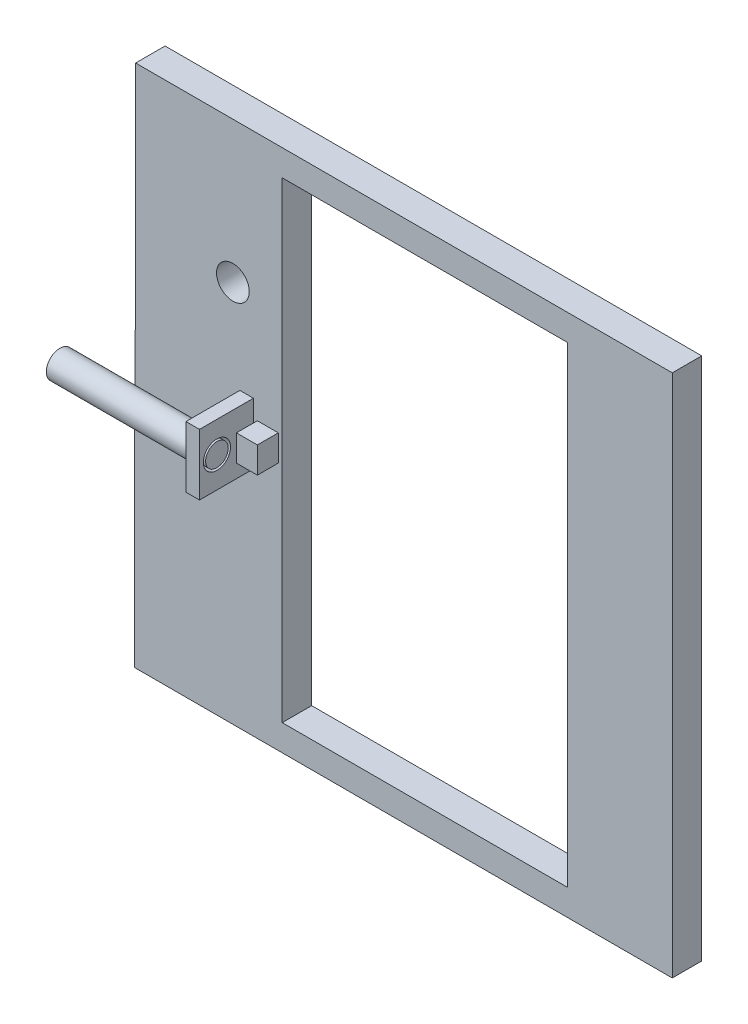
ISO-10303-21;
HEADER;
FILE_DESCRIPTION(('STEP AP214'),'2;1');
FILE_NAME('part.step','',(''),(''),'','','');
FILE_SCHEMA(('AUTOMOTIVE_DESIGN { 1 0 10303 214 1 1 1 1 }'));
ENDSEC;
DATA;
#1=APPLICATION_CONTEXT('core data for automotive mechanical design processes');
#2=APPLICATION_PROTOCOL_DEFINITION('international standard','automotive_design',2000,#1);
#3=PRODUCT_CONTEXT('',#1,'mechanical');
#4=PRODUCT('Part','Part','',(#3));
#5=PRODUCT_RELATED_PRODUCT_CATEGORY('part','',(#4));
#6=PRODUCT_DEFINITION_FORMATION('','',#4);
#7=PRODUCT_DEFINITION_CONTEXT('part definition',#1,'design');
#8=PRODUCT_DEFINITION('design','',#6,#7);
#9=PRODUCT_DEFINITION_SHAPE('','',#8);
#10=(LENGTH_UNIT() NAMED_UNIT(*) SI_UNIT(.MILLI.,.METRE.));
#11=(NAMED_UNIT(*) PLANE_ANGLE_UNIT() SI_UNIT($,.RADIAN.));
#12=(NAMED_UNIT(*) SI_UNIT($,.STERADIAN.) SOLID_ANGLE_UNIT());
#13=UNCERTAINTY_MEASURE_WITH_UNIT(LENGTH_MEASURE(1.E-05),#10,'distance_accuracy_value','');
#14=(GEOMETRIC_REPRESENTATION_CONTEXT(3) GLOBAL_UNCERTAINTY_ASSIGNED_CONTEXT((#13)) GLOBAL_UNIT_ASSIGNED_CONTEXT((#10,
#11,#12)) REPRESENTATION_CONTEXT('',''));
#15=CARTESIAN_POINT('',(0.,0.,0.));
#16=DIRECTION('',(0.,0.,1.));
#17=DIRECTION('',(1.,0.,0.));
#18=AXIS2_PLACEMENT_3D('',#15,#16,#17);
#19=CARTESIAN_POINT('',(-89.7638857165429,-14.8345030764574,-13.6525));
#20=DIRECTION('',(0.,1.,0.));
#21=DIRECTION('',(-1.,0.,0.));
#22=AXIS2_PLACEMENT_3D('',#19,#20,#21);
#23=PLANE('',#22);
#24=DIRECTION('',(1.,0.,0.));
#25=VECTOR('',#24,1.);
#26=CARTESIAN_POINT('',(-140.843,-14.8345030764574,-12.7));
#27=LINE('',#26,#25);
#28=CARTESIAN_POINT('',(-140.563885716543,-14.8345030764574,-12.7));
#29=VERTEX_POINT('',#28);
#30=CARTESIAN_POINT('',(-83.185,-14.8345030764574,-12.7));
#31=VERTEX_POINT('',#30);
#32=EDGE_CURVE('E222',#29,#31,#27,.T.);
#33=ORIENTED_EDGE('',*,*,#32,.F.);
#34=DIRECTION('',(0.,0.,1.));
#35=VECTOR('',#34,1.);
#36=CARTESIAN_POINT('',(-140.563885716543,-14.8345030764574,-13.6525));
#37=LINE('',#36,#35);
#38=CARTESIAN_POINT('',(-140.563885716543,-14.8345030764574,-13.6525));
#39=VERTEX_POINT('',#38);
#40=EDGE_CURVE('E247',#39,#29,#37,.T.);
#41=ORIENTED_EDGE('',*,*,#40,.F.);
#42=DIRECTION('',(1.,0.,0.));
#43=VECTOR('',#42,1.);
#44=CARTESIAN_POINT('',(-89.7638857165429,-14.8345030764574,-13.6525));
#45=LINE('',#44,#43);
#46=CARTESIAN_POINT('',(-83.185,-14.8345030764574,-13.6525));
#47=VERTEX_POINT('',#46);
#48=EDGE_CURVE('E300',#39,#47,#45,.T.);
#49=ORIENTED_EDGE('',*,*,#48,.T.);
#50=DIRECTION('',(0.,0.,1.));
#51=VECTOR('',#50,1.);
#52=CARTESIAN_POINT('',(-83.185,-14.8345030764574,-13.6525));
#53=LINE('',#52,#51);
#54=EDGE_CURVE('E298',#47,#31,#53,.T.);
#55=ORIENTED_EDGE('',*,*,#54,.T.);
#56=EDGE_LOOP('',(#33,#41,#49,#55));
#57=FACE_BOUND('',#56,.T.);
#58=ADVANCED_FACE('F37',(#57),#23,.F.);
#59=DIRECTION('',(1.,0.,0.));
#60=VECTOR('',#59,1.);
#61=CARTESIAN_POINT('',(-140.843,-14.8345030764574,1.5875));
#62=LINE('',#61,#60);
#63=CARTESIAN_POINT('',(-89.7638857165429,-14.8345030764574,1.5875));
#64=VERTEX_POINT('',#63);
#65=CARTESIAN_POINT('',(-83.185,-14.8345030764574,1.5875));
#66=VERTEX_POINT('',#65);
#67=EDGE_CURVE('E225',#64,#66,#62,.T.);
#68=ORIENTED_EDGE('',*,*,#67,.T.);
#69=DIRECTION('',(0.,0.,-1.));
#70=VECTOR('',#69,1.);
#71=CARTESIAN_POINT('',(-83.185,-14.8345030764574,27.7495));
#72=LINE('',#71,#70);
#73=CARTESIAN_POINT('',(-83.185,-14.8345030764574,27.7495));
#74=VERTEX_POINT('',#73);
#75=EDGE_CURVE('E290',#74,#66,#72,.T.);
#76=ORIENTED_EDGE('',*,*,#75,.F.);
#77=DIRECTION('',(1.,0.,0.));
#78=VECTOR('',#77,1.);
#79=CARTESIAN_POINT('',(-89.7638857165429,-14.8345030764574,27.7495));
#80=LINE('',#79,#78);
#81=CARTESIAN_POINT('',(-89.7638857165429,-14.8345030764574,27.7495));
#82=VERTEX_POINT('',#81);
#83=EDGE_CURVE('E279',#82,#74,#80,.T.);
#84=ORIENTED_EDGE('',*,*,#83,.F.);
#85=DIRECTION('',(0.,0.,1.));
#86=VECTOR('',#85,1.);
#87=CARTESIAN_POINT('',(-89.7638857165429,-14.8345030764574,-13.6525));
#88=LINE('',#87,#86);
#89=EDGE_CURVE('E297',#64,#82,#88,.T.);
#90=ORIENTED_EDGE('',*,*,#89,.F.);
#91=EDGE_LOOP('',(#68,#76,#84,#90));
#92=FACE_BOUND('',#91,.T.);
#93=ADVANCED_FACE('F428',(#92),#23,.F.);
#94=CARTESIAN_POINT('',(-89.7638857165429,14.8592290009901,-13.6525));
#95=DIRECTION('',(0.,-1.,0.));
#96=DIRECTION('',(1.,0.,0.));
#97=AXIS2_PLACEMENT_3D('',#94,#95,#96);
#98=PLANE('',#97);
#99=DIRECTION('',(1.,0.,0.));
#100=VECTOR('',#99,1.);
#101=CARTESIAN_POINT('',(-140.335,14.8592290009901,1.5875));
#102=LINE('',#101,#100);
#103=CARTESIAN_POINT('',(-89.7638857165429,14.8592290009901,1.5875));
#104=VERTEX_POINT('',#103);
#105=CARTESIAN_POINT('',(-83.185,14.8592290009901,1.5875));
#106=VERTEX_POINT('',#105);
#107=EDGE_CURVE('E237',#104,#106,#102,.T.);
#108=ORIENTED_EDGE('',*,*,#107,.F.);
#109=DIRECTION('',(0.,0.,-1.));
#110=VECTOR('',#109,1.);
#111=CARTESIAN_POINT('',(-89.7638857165429,14.8592290009901,-13.6525));
#112=LINE('',#111,#110);
#113=CARTESIAN_POINT('',(-89.7638857165429,14.8592290009901,27.7495));
#114=VERTEX_POINT('',#113);
#115=EDGE_CURVE('E294',#114,#104,#112,.T.);
#116=ORIENTED_EDGE('',*,*,#115,.F.);
#117=DIRECTION('',(-1.,0.,0.));
#118=VECTOR('',#117,1.);
#119=CARTESIAN_POINT('',(-89.7638857165429,14.8592290009901,27.7495));
#120=LINE('',#119,#118);
#121=CARTESIAN_POINT('',(-83.185,14.8592290009901,27.7495));
#122=VERTEX_POINT('',#121);
#123=EDGE_CURVE('E283',#122,#114,#120,.T.);
#124=ORIENTED_EDGE('',*,*,#123,.F.);
#125=DIRECTION('',(0.,0.,-1.));
#126=VECTOR('',#125,1.);
#127=CARTESIAN_POINT('',(-83.185,14.8592290009901,27.7495));
#128=LINE('',#127,#126);
#129=EDGE_CURVE('E286',#122,#106,#128,.T.);
#130=ORIENTED_EDGE('',*,*,#129,.T.);
#131=EDGE_LOOP('',(#108,#116,#124,#130));
#132=FACE_BOUND('',#131,.T.);
#133=ADVANCED_FACE('F420',(#132),#98,.F.);
#134=DIRECTION('',(1.,0.,0.));
#135=VECTOR('',#134,1.);
#136=CARTESIAN_POINT('',(-140.335,14.8592290009901,-12.7));
#137=LINE('',#136,#135);
#138=CARTESIAN_POINT('',(-140.335,14.8592290009901,-12.7));
#139=VERTEX_POINT('',#138);
#140=CARTESIAN_POINT('',(-83.185,14.8592290009901,-12.7));
#141=VERTEX_POINT('',#140);
#142=EDGE_CURVE('E240',#139,#141,#137,.T.);
#143=ORIENTED_EDGE('',*,*,#142,.T.);
#144=DIRECTION('',(0.,0.,-1.));
#145=VECTOR('',#144,1.);
#146=CARTESIAN_POINT('',(-83.185,14.8592290009901,-13.6525));
#147=LINE('',#146,#145);
#148=CARTESIAN_POINT('',(-83.185,14.8592290009901,-13.6525));
#149=VERTEX_POINT('',#148);
#150=EDGE_CURVE('E293',#141,#149,#147,.T.);
#151=ORIENTED_EDGE('',*,*,#150,.T.);
#152=DIRECTION('',(1.,0.,0.));
#153=VECTOR('',#152,1.);
#154=CARTESIAN_POINT('',(-89.7638857165429,14.8592290009901,-13.6525));
#155=LINE('',#154,#153);
#156=CARTESIAN_POINT('',(-140.563885716543,14.8592290009901,-13.6525));
#157=VERTEX_POINT('',#156);
#158=EDGE_CURVE('E308',#157,#149,#155,.T.);
#159=ORIENTED_EDGE('',*,*,#158,.F.);
#160=DIRECTION('',(0.,0.,-1.));
#161=VECTOR('',#160,1.);
#162=CARTESIAN_POINT('',(-140.563885716543,14.8592290009901,-13.6525));
#163=LINE('',#162,#161);
#164=CARTESIAN_POINT('',(-140.563885716543,14.8592290009901,1.5875));
#165=VERTEX_POINT('',#164);
#166=EDGE_CURVE('E252',#165,#157,#163,.T.);
#167=ORIENTED_EDGE('',*,*,#166,.F.);
#168=DIRECTION('',(1.,0.,0.));
#169=VECTOR('',#168,1.);
#170=CARTESIAN_POINT('',(-140.563885716543,14.8592290009901,1.5875));
#171=LINE('',#170,#169);
#172=CARTESIAN_POINT('',(-140.335,14.8592290009901,1.5875));
#173=VERTEX_POINT('',#172);
#174=EDGE_CURVE('E59',#165,#173,#171,.T.);
#175=ORIENTED_EDGE('',*,*,#174,.T.);
#176=DIRECTION('',(0.,0.,1.));
#177=VECTOR('',#176,1.);
#178=CARTESIAN_POINT('',(-140.335,14.8592290009901,-12.7));
#179=LINE('',#178,#177);
#180=EDGE_CURVE('E54',#139,#173,#179,.T.);
#181=ORIENTED_EDGE('',*,*,#180,.F.);
#182=EDGE_LOOP('',(#143,#151,#159,#167,#175,#181));
#183=FACE_BOUND('',#182,.T.);
#184=ADVANCED_FACE('F417',(#183),#98,.F.);
#185=CARTESIAN_POINT('',(-89.7638857165429,0.,0.));
#186=DIRECTION('',(1.,0.,0.));
#187=DIRECTION('',(0.,0.,-1.));
#188=AXIS2_PLACEMENT_3D('',#185,#186,#187);
#189=PLANE('',#188);
#190=CARTESIAN_POINT('',(-89.7638857165429,0.,19.2912049724316));
#191=DIRECTION('',(1.,0.,0.));
#192=DIRECTION('',(0.,0.,-1.));
#193=AXIS2_PLACEMENT_3D('',#190,#191,#192);
#194=CIRCLE('',#193,6.604);
#195=CARTESIAN_POINT('',(-89.7638857165429,0.,12.6872049724316));
#196=VERTEX_POINT('',#195);
#197=EDGE_CURVE('E272',#196,#196,#194,.T.);
#198=ORIENTED_EDGE('',*,*,#197,.T.);
#199=EDGE_LOOP('',(#198));
#200=FACE_BOUND('',#199,.T.);
#201=DIRECTION('',(0.,1.,0.));
#202=VECTOR('',#201,1.);
#203=CARTESIAN_POINT('',(-89.7638857165429,14.8592290009901,1.5875));
#204=LINE('',#203,#202);
#205=EDGE_CURVE('E242',#64,#104,#204,.T.);
#206=ORIENTED_EDGE('',*,*,#205,.F.);
#207=ORIENTED_EDGE('',*,*,#89,.T.);
#208=DIRECTION('',(0.,-1.,0.));
#209=VECTOR('',#208,1.);
#210=CARTESIAN_POINT('',(-89.7638857165429,14.8592290009901,27.7495));
#211=LINE('',#210,#209);
#212=EDGE_CURVE('E276',#114,#82,#211,.T.);
#213=ORIENTED_EDGE('',*,*,#212,.F.);
#214=ORIENTED_EDGE('',*,*,#115,.T.);
#215=EDGE_LOOP('',(#206,#207,#213,#214));
#216=FACE_BOUND('',#215,.T.);
#217=ADVANCED_FACE('F419',(#200,#216),#189,.F.);
#218=CARTESIAN_POINT('',(0.,0.,1.5875));
#219=DIRECTION('',(0.,0.,-1.));
#220=DIRECTION('',(-1.,0.,0.));
#221=AXIS2_PLACEMENT_3D('',#218,#219,#220);
#222=PLANE('',#221);
#223=CARTESIAN_POINT('',(-93.1412298345902,58.5900880823517,1.5875));
#224=DIRECTION('',(0.,0.,1.));
#225=DIRECTION('',(1.,0.,0.));
#226=AXIS2_PLACEMENT_3D('',#223,#224,#225);
#227=CIRCLE('',#226,7.93749999999999);
#228=CARTESIAN_POINT('',(-85.2037298345902,58.5900880823517,1.5875));
#229=VERTEX_POINT('',#228);
#230=EDGE_CURVE('E217',#229,#229,#227,.T.);
#231=ORIENTED_EDGE('',*,*,#230,.F.);
#232=EDGE_LOOP('',(#231));
#233=FACE_BOUND('',#232,.T.);
#234=DIRECTION('',(0.,1.,0.));
#235=VECTOR('',#234,1.);
#236=CARTESIAN_POINT('',(-140.843,-14.8345030764574,1.5875));
#237=LINE('',#236,#235);
#238=CARTESIAN_POINT('',(-140.843,-127.127,1.5875));
#239=VERTEX_POINT('',#238);
#240=CARTESIAN_POINT('',(-140.843,-14.8345030764574,1.5875));
#241=VERTEX_POINT('',#240);
#242=EDGE_CURVE('E209',#239,#241,#237,.T.);
#243=ORIENTED_EDGE('',*,*,#242,.F.);
#244=DIRECTION('',(1.,0.,0.));
#245=VECTOR('',#244,1.);
#246=CARTESIAN_POINT('',(120.015,-127.127,1.5875));
#247=LINE('',#246,#245);
#248=CARTESIAN_POINT('',(120.015,-127.127,1.5875));
#249=VERTEX_POINT('',#248);
#250=EDGE_CURVE('E206',#239,#249,#247,.T.);
#251=ORIENTED_EDGE('',*,*,#250,.T.);
#252=DIRECTION('',(0.,1.,0.));
#253=VECTOR('',#252,1.);
#254=CARTESIAN_POINT('',(120.015,127.127,1.5875));
#255=LINE('',#254,#253);
#256=CARTESIAN_POINT('',(120.015,127.127,1.5875));
#257=VERTEX_POINT('',#256);
#258=EDGE_CURVE('E356',#249,#257,#255,.T.);
#259=ORIENTED_EDGE('',*,*,#258,.T.);
#260=DIRECTION('',(-1.,0.,0.));
#261=VECTOR('',#260,1.);
#262=CARTESIAN_POINT('',(120.015,127.127,1.5875));
#263=LINE('',#262,#261);
#264=CARTESIAN_POINT('',(-140.335,127.127,1.5875));
#265=VERTEX_POINT('',#264);
#266=EDGE_CURVE('E359',#257,#265,#263,.T.);
#267=ORIENTED_EDGE('',*,*,#266,.T.);
#268=DIRECTION('',(0.,1.,0.));
#269=VECTOR('',#268,1.);
#270=CARTESIAN_POINT('',(-140.335,127.127,1.5875));
#271=LINE('',#270,#269);
#272=EDGE_CURVE('E231',#173,#265,#271,.T.);
#273=ORIENTED_EDGE('',*,*,#272,.F.);
#274=ORIENTED_EDGE('',*,*,#174,.F.);
#275=DIRECTION('',(0.,1.,0.));
#276=VECTOR('',#275,1.);
#277=CARTESIAN_POINT('',(-140.563885716543,14.8592290009901,1.5875));
#278=LINE('',#277,#276);
#279=CARTESIAN_POINT('',(-140.563885716543,-14.8345030764574,1.5875));
#280=VERTEX_POINT('',#279);
#281=EDGE_CURVE('E250',#280,#165,#278,.T.);
#282=ORIENTED_EDGE('',*,*,#281,.F.);
#283=EDGE_CURVE('E226',#241,#280,#62,.T.);
#284=ORIENTED_EDGE('',*,*,#283,.F.);
#285=EDGE_LOOP('',(#243,#251,#259,#267,#273,#274,#282,#284));
#286=FACE_BOUND('',#285,.T.);
#287=DIRECTION('',(0.,1.,0.));
#288=VECTOR('',#287,1.);
#289=CARTESIAN_POINT('',(-71.12,-6.35,1.5875));
#290=LINE('',#289,#288);
#291=CARTESIAN_POINT('',(-71.12,-6.35,1.5875));
#292=VERTEX_POINT('',#291);
#293=CARTESIAN_POINT('',(-71.12,6.35,1.5875));
#294=VERTEX_POINT('',#293);
#295=EDGE_CURVE('E311',#292,#294,#290,.T.);
#296=ORIENTED_EDGE('',*,*,#295,.F.);
#297=DIRECTION('',(1.,0.,0.));
#298=VECTOR('',#297,1.);
#299=CARTESIAN_POINT('',(-81.28,-6.35,1.5875));
#300=LINE('',#299,#298);
#301=CARTESIAN_POINT('',(-81.28,-6.35,1.5875));
#302=VERTEX_POINT('',#301);
#303=EDGE_CURVE('E316',#302,#292,#300,.T.);
#304=ORIENTED_EDGE('',*,*,#303,.F.);
#305=DIRECTION('',(0.,-1.,0.));
#306=VECTOR('',#305,1.);
#307=CARTESIAN_POINT('',(-81.28,-6.35,1.5875));
#308=LINE('',#307,#306);
#309=CARTESIAN_POINT('',(-81.28,6.35,1.5875));
#310=VERTEX_POINT('',#309);
#311=EDGE_CURVE('E328',#310,#302,#308,.T.);
#312=ORIENTED_EDGE('',*,*,#311,.F.);
#313=DIRECTION('',(-1.,0.,0.));
#314=VECTOR('',#313,1.);
#315=CARTESIAN_POINT('',(-81.28,6.35,1.5875));
#316=LINE('',#315,#314);
#317=EDGE_CURVE('E325',#294,#310,#316,.T.);
#318=ORIENTED_EDGE('',*,*,#317,.F.);
#319=EDGE_LOOP('',(#296,#304,#312,#318));
#320=FACE_BOUND('',#319,.T.);
#321=DIRECTION('',(0.,1.,0.));
#322=VECTOR('',#321,1.);
#323=CARTESIAN_POINT('',(69.215,-114.45875,1.5875));
#324=LINE('',#323,#322);
#325=CARTESIAN_POINT('',(69.215,-114.45875,1.5875));
#326=VERTEX_POINT('',#325);
#327=CARTESIAN_POINT('',(69.215,114.45875,1.5875));
#328=VERTEX_POINT('',#327);
#329=EDGE_CURVE('E344',#326,#328,#324,.T.);
#330=ORIENTED_EDGE('',*,*,#329,.F.);
#331=DIRECTION('',(1.,0.,0.));
#332=VECTOR('',#331,1.);
#333=CARTESIAN_POINT('',(-69.215,-114.45875,1.5875));
#334=LINE('',#333,#332);
#335=CARTESIAN_POINT('',(-69.215,-114.45875,1.5875));
#336=VERTEX_POINT('',#335);
#337=EDGE_CURVE('E353',#336,#326,#334,.T.);
#338=ORIENTED_EDGE('',*,*,#337,.F.);
#339=DIRECTION('',(0.,-1.,0.));
#340=VECTOR('',#339,1.);
#341=CARTESIAN_POINT('',(-69.215,-114.45875,1.5875));
#342=LINE('',#341,#340);
#343=CARTESIAN_POINT('',(-69.215,114.45875,1.5875));
#344=VERTEX_POINT('',#343);
#345=EDGE_CURVE('E350',#344,#336,#342,.T.);
#346=ORIENTED_EDGE('',*,*,#345,.F.);
#347=DIRECTION('',(-1.,0.,0.));
#348=VECTOR('',#347,1.);
#349=CARTESIAN_POINT('',(-69.215,114.45875,1.5875));
#350=LINE('',#349,#348);
#351=EDGE_CURVE('E347',#328,#344,#350,.T.);
#352=ORIENTED_EDGE('',*,*,#351,.F.);
#353=EDGE_LOOP('',(#330,#338,#346,#352));
#354=FACE_BOUND('',#353,.T.);
#355=DIRECTION('',(0.,1.,0.));
#356=VECTOR('',#355,1.);
#357=CARTESIAN_POINT('',(-83.185,14.8592290009901,1.5875));
#358=LINE('',#357,#356);
#359=EDGE_CURVE('E275',#66,#106,#358,.T.);
#360=ORIENTED_EDGE('',*,*,#359,.F.);
#361=ORIENTED_EDGE('',*,*,#67,.F.);
#362=ORIENTED_EDGE('',*,*,#205,.T.);
#363=ORIENTED_EDGE('',*,*,#107,.T.);
#364=EDGE_LOOP('',(#360,#361,#362,#363));
#365=FACE_BOUND('',#364,.T.);
#366=ADVANCED_FACE('F394',(#233,#286,#320,#354,#365),#222,.F.);
#367=CARTESIAN_POINT('',(120.015,127.127,-12.7));
#368=DIRECTION('',(1.,0.,0.));
#369=DIRECTION('',(0.,1.,0.));
#370=AXIS2_PLACEMENT_3D('',#367,#368,#369);
#371=PLANE('',#370);
#372=DIRECTION('',(0.,0.,1.));
#373=VECTOR('',#372,1.);
#374=CARTESIAN_POINT('',(120.015,127.127,-12.7));
#375=LINE('',#374,#373);
#376=CARTESIAN_POINT('',(120.015,127.127,-12.7));
#377=VERTEX_POINT('',#376);
#378=EDGE_CURVE('E46',#377,#257,#375,.T.);
#379=ORIENTED_EDGE('',*,*,#378,.T.);
#380=ORIENTED_EDGE('',*,*,#258,.F.);
#381=DIRECTION('',(0.,0.,1.));
#382=VECTOR('',#381,1.);
#383=CARTESIAN_POINT('',(120.015,-127.127,-12.7));
#384=LINE('',#383,#382);
#385=CARTESIAN_POINT('',(120.015,-127.127,-12.7));
#386=VERTEX_POINT('',#385);
#387=EDGE_CURVE('E11',#386,#249,#384,.T.);
#388=ORIENTED_EDGE('',*,*,#387,.F.);
#389=DIRECTION('',(0.,1.,0.));
#390=VECTOR('',#389,1.);
#391=CARTESIAN_POINT('',(120.015,127.127,-12.7));
#392=LINE('',#391,#390);
#393=EDGE_CURVE('E198',#386,#377,#392,.T.);
#394=ORIENTED_EDGE('',*,*,#393,.T.);
#395=EDGE_LOOP('',(#379,#380,#388,#394));
#396=FACE_BOUND('',#395,.T.);
#397=ADVANCED_FACE('F39',(#396),#371,.T.);
#398=CARTESIAN_POINT('',(120.015,-127.127,-12.7));
#399=DIRECTION('',(0.,-1.,0.));
#400=DIRECTION('',(1.,0.,0.));
#401=AXIS2_PLACEMENT_3D('',#398,#399,#400);
#402=PLANE('',#401);
#403=ORIENTED_EDGE('',*,*,#387,.T.);
#404=ORIENTED_EDGE('',*,*,#250,.F.);
#405=DIRECTION('',(0.,0.,1.));
#406=VECTOR('',#405,1.);
#407=CARTESIAN_POINT('',(-140.843,-127.127,-12.7));
#408=LINE('',#407,#406);
#409=CARTESIAN_POINT('',(-140.843,-127.127,-12.7));
#410=VERTEX_POINT('',#409);
#411=EDGE_CURVE('E203',#410,#239,#408,.T.);
#412=ORIENTED_EDGE('',*,*,#411,.F.);
#413=DIRECTION('',(1.,0.,0.));
#414=VECTOR('',#413,1.);
#415=CARTESIAN_POINT('',(120.015,-127.127,-12.7));
#416=LINE('',#415,#414);
#417=EDGE_CURVE('E190',#410,#386,#416,.T.);
#418=ORIENTED_EDGE('',*,*,#417,.T.);
#419=EDGE_LOOP('',(#403,#404,#412,#418));
#420=FACE_BOUND('',#419,.T.);
#421=ADVANCED_FACE('F204',(#420),#402,.T.);
#422=CARTESIAN_POINT('',(120.015,127.127,-12.7));
#423=DIRECTION('',(0.,1.,0.));
#424=DIRECTION('',(-1.,0.,0.));
#425=AXIS2_PLACEMENT_3D('',#422,#423,#424);
#426=PLANE('',#425);
#427=DIRECTION('',(-1.,0.,0.));
#428=VECTOR('',#427,1.);
#429=CARTESIAN_POINT('',(120.015,127.127,-12.7));
#430=LINE('',#429,#428);
#431=CARTESIAN_POINT('',(-140.335,127.127,-12.7));
#432=VERTEX_POINT('',#431);
#433=EDGE_CURVE('E383',#377,#432,#430,.T.);
#434=ORIENTED_EDGE('',*,*,#433,.T.);
#435=DIRECTION('',(0.,0.,-1.));
#436=VECTOR('',#435,1.);
#437=CARTESIAN_POINT('',(-140.335,127.127,-12.7));
#438=LINE('',#437,#436);
#439=EDGE_CURVE('E234',#265,#432,#438,.T.);
#440=ORIENTED_EDGE('',*,*,#439,.F.);
#441=ORIENTED_EDGE('',*,*,#266,.F.);
#442=ORIENTED_EDGE('',*,*,#378,.F.);
#443=EDGE_LOOP('',(#434,#440,#441,#442));
#444=FACE_BOUND('',#443,.T.);
#445=ADVANCED_FACE('F391',(#444),#426,.T.);
#446=CARTESIAN_POINT('',(0.,0.,-12.7));
#447=DIRECTION('',(0.,0.,-1.));
#448=DIRECTION('',(-1.,0.,0.));
#449=AXIS2_PLACEMENT_3D('',#446,#447,#448);
#450=PLANE('',#449);
#451=CARTESIAN_POINT('',(-93.1412298345902,58.5900880823517,-12.7));
#452=DIRECTION('',(0.,0.,-1.));
#453=DIRECTION('',(-1.,0.,0.));
#454=AXIS2_PLACEMENT_3D('',#451,#452,#453);
#455=CIRCLE('',#454,7.93749999999999);
#456=CARTESIAN_POINT('',(-101.07872983459,58.5900880823517,-12.7));
#457=VERTEX_POINT('',#456);
#458=EDGE_CURVE('E41',#457,#457,#455,.T.);
#459=ORIENTED_EDGE('',*,*,#458,.F.);
#460=EDGE_LOOP('',(#459));
#461=FACE_BOUND('',#460,.T.);
#462=DIRECTION('',(0.,1.,0.));
#463=VECTOR('',#462,1.);
#464=CARTESIAN_POINT('',(69.215,-114.45875,-12.7));
#465=LINE('',#464,#463);
#466=CARTESIAN_POINT('',(69.215,-114.45875,-12.7));
#467=VERTEX_POINT('',#466);
#468=CARTESIAN_POINT('',(69.215,114.45875,-12.7));
#469=VERTEX_POINT('',#468);
#470=EDGE_CURVE('E362',#467,#469,#465,.T.);
#471=ORIENTED_EDGE('',*,*,#470,.T.);
#472=DIRECTION('',(-1.,0.,0.));
#473=VECTOR('',#472,1.);
#474=CARTESIAN_POINT('',(-69.215,114.45875,-12.7));
#475=LINE('',#474,#473);
#476=CARTESIAN_POINT('',(-69.215,114.45875,-12.7));
#477=VERTEX_POINT('',#476);
#478=EDGE_CURVE('E365',#469,#477,#475,.T.);
#479=ORIENTED_EDGE('',*,*,#478,.T.);
#480=DIRECTION('',(0.,-1.,0.));
#481=VECTOR('',#480,1.);
#482=CARTESIAN_POINT('',(-69.215,-114.45875,-12.7));
#483=LINE('',#482,#481);
#484=CARTESIAN_POINT('',(-69.215,-114.45875,-12.7));
#485=VERTEX_POINT('',#484);
#486=EDGE_CURVE('E368',#477,#485,#483,.T.);
#487=ORIENTED_EDGE('',*,*,#486,.T.);
#488=DIRECTION('',(1.,0.,0.));
#489=VECTOR('',#488,1.);
#490=CARTESIAN_POINT('',(-69.215,-114.45875,-12.7));
#491=LINE('',#490,#489);
#492=EDGE_CURVE('E371',#485,#467,#491,.T.);
#493=ORIENTED_EDGE('',*,*,#492,.T.);
#494=EDGE_LOOP('',(#471,#479,#487,#493));
#495=FACE_BOUND('',#494,.T.);
#496=ORIENTED_EDGE('',*,*,#393,.F.);
#497=ORIENTED_EDGE('',*,*,#417,.F.);
#498=DIRECTION('',(0.,-1.,0.));
#499=VECTOR('',#498,1.);
#500=CARTESIAN_POINT('',(-140.843,-14.8345030764574,-12.7));
#501=LINE('',#500,#499);
#502=CARTESIAN_POINT('',(-140.843,-14.8345030764574,-12.7));
#503=VERTEX_POINT('',#502);
#504=EDGE_CURVE('E195',#503,#410,#501,.T.);
#505=ORIENTED_EDGE('',*,*,#504,.F.);
#506=EDGE_CURVE('E223',#503,#29,#27,.T.);
#507=ORIENTED_EDGE('',*,*,#506,.T.);
#508=ORIENTED_EDGE('',*,*,#32,.T.);
#509=DIRECTION('',(0.,-1.,0.));
#510=VECTOR('',#509,1.);
#511=CARTESIAN_POINT('',(-83.185,127.127,-12.7));
#512=LINE('',#511,#510);
#513=EDGE_CURVE('E200',#141,#31,#512,.T.);
#514=ORIENTED_EDGE('',*,*,#513,.F.);
#515=ORIENTED_EDGE('',*,*,#142,.F.);
#516=DIRECTION('',(0.,-1.,0.));
#517=VECTOR('',#516,1.);
#518=CARTESIAN_POINT('',(-140.335,127.127,-12.7));
#519=LINE('',#518,#517);
#520=EDGE_CURVE('E228',#432,#139,#519,.T.);
#521=ORIENTED_EDGE('',*,*,#520,.F.);
#522=ORIENTED_EDGE('',*,*,#433,.F.);
#523=EDGE_LOOP('',(#496,#497,#505,#507,#508,#514,#515,#521,#522));
#524=FACE_BOUND('',#523,.T.);
#525=ADVANCED_FACE('F192',(#461,#495,#524),#450,.T.);
#526=CARTESIAN_POINT('',(69.215,-114.45875,-12.7));
#527=DIRECTION('',(1.,0.,0.));
#528=DIRECTION('',(0.,0.,-1.));
#529=AXIS2_PLACEMENT_3D('',#526,#527,#528);
#530=PLANE('',#529);
#531=DIRECTION('',(0.,0.,1.));
#532=VECTOR('',#531,1.);
#533=CARTESIAN_POINT('',(69.215,-114.45875,-12.7));
#534=LINE('',#533,#532);
#535=EDGE_CURVE('E375',#467,#326,#534,.T.);
#536=ORIENTED_EDGE('',*,*,#535,.T.);
#537=ORIENTED_EDGE('',*,*,#329,.T.);
#538=DIRECTION('',(0.,0.,1.));
#539=VECTOR('',#538,1.);
#540=CARTESIAN_POINT('',(69.215,114.45875,-12.7));
#541=LINE('',#540,#539);
#542=EDGE_CURVE('E374',#469,#328,#541,.T.);
#543=ORIENTED_EDGE('',*,*,#542,.F.);
#544=ORIENTED_EDGE('',*,*,#470,.F.);
#545=EDGE_LOOP('',(#536,#537,#543,#544));
#546=FACE_BOUND('',#545,.T.);
#547=ADVANCED_FACE('F474',(#546),#530,.F.);
#548=CARTESIAN_POINT('',(-69.215,-114.45875,-12.7));
#549=DIRECTION('',(0.,-1.,0.));
#550=DIRECTION('',(0.,0.,-1.));
#551=AXIS2_PLACEMENT_3D('',#548,#549,#550);
#552=PLANE('',#551);
#553=DIRECTION('',(0.,0.,1.));
#554=VECTOR('',#553,1.);
#555=CARTESIAN_POINT('',(-69.215,-114.45875,-12.7));
#556=LINE('',#555,#554);
#557=EDGE_CURVE('E377',#485,#336,#556,.T.);
#558=ORIENTED_EDGE('',*,*,#557,.T.);
#559=ORIENTED_EDGE('',*,*,#337,.T.);
#560=ORIENTED_EDGE('',*,*,#535,.F.);
#561=ORIENTED_EDGE('',*,*,#492,.F.);
#562=EDGE_LOOP('',(#558,#559,#560,#561));
#563=FACE_BOUND('',#562,.T.);
#564=ADVANCED_FACE('F470',(#563),#552,.F.);
#565=CARTESIAN_POINT('',(-69.215,-114.45875,-12.7));
#566=DIRECTION('',(-1.,0.,0.));
#567=DIRECTION('',(0.,0.,1.));
#568=AXIS2_PLACEMENT_3D('',#565,#566,#567);
#569=PLANE('',#568);
#570=DIRECTION('',(0.,0.,1.));
#571=VECTOR('',#570,1.);
#572=CARTESIAN_POINT('',(-69.215,114.45875,-12.7));
#573=LINE('',#572,#571);
#574=EDGE_CURVE('E379',#477,#344,#573,.T.);
#575=ORIENTED_EDGE('',*,*,#574,.T.);
#576=ORIENTED_EDGE('',*,*,#345,.T.);
#577=ORIENTED_EDGE('',*,*,#557,.F.);
#578=ORIENTED_EDGE('',*,*,#486,.F.);
#579=EDGE_LOOP('',(#575,#576,#577,#578));
#580=FACE_BOUND('',#579,.T.);
#581=ADVANCED_FACE('F473',(#580),#569,.F.);
#582=CARTESIAN_POINT('',(-69.215,114.45875,-12.7));
#583=DIRECTION('',(0.,1.,0.));
#584=DIRECTION('',(0.,0.,1.));
#585=AXIS2_PLACEMENT_3D('',#582,#583,#584);
#586=PLANE('',#585);
#587=ORIENTED_EDGE('',*,*,#542,.T.);
#588=ORIENTED_EDGE('',*,*,#351,.T.);
#589=ORIENTED_EDGE('',*,*,#574,.F.);
#590=ORIENTED_EDGE('',*,*,#478,.F.);
#591=EDGE_LOOP('',(#587,#588,#589,#590));
#592=FACE_BOUND('',#591,.T.);
#593=ADVANCED_FACE('F465',(#592),#586,.F.);
#594=CARTESIAN_POINT('',(-71.12,-6.35,11.7475));
#595=DIRECTION('',(-1.,0.,0.));
#596=DIRECTION('',(0.,0.,1.));
#597=AXIS2_PLACEMENT_3D('',#594,#595,#596);
#598=PLANE('',#597);
#599=ORIENTED_EDGE('',*,*,#295,.T.);
#600=DIRECTION('',(0.,0.,-1.));
#601=VECTOR('',#600,1.);
#602=CARTESIAN_POINT('',(-71.12,6.35,11.7475));
#603=LINE('',#602,#601);
#604=CARTESIAN_POINT('',(-71.12,6.35,11.7475));
#605=VERTEX_POINT('',#604);
#606=EDGE_CURVE('E341',#605,#294,#603,.T.);
#607=ORIENTED_EDGE('',*,*,#606,.F.);
#608=DIRECTION('',(0.,1.,0.));
#609=VECTOR('',#608,1.);
#610=CARTESIAN_POINT('',(-71.12,-6.35,11.7475));
#611=LINE('',#610,#609);
#612=CARTESIAN_POINT('',(-71.12,-6.35,11.7475));
#613=VERTEX_POINT('',#612);
#614=EDGE_CURVE('E312',#613,#605,#611,.T.);
#615=ORIENTED_EDGE('',*,*,#614,.F.);
#616=DIRECTION('',(0.,0.,-1.));
#617=VECTOR('',#616,1.);
#618=CARTESIAN_POINT('',(-71.12,-6.35,11.7475));
#619=LINE('',#618,#617);
#620=EDGE_CURVE('E322',#613,#292,#619,.T.);
#621=ORIENTED_EDGE('',*,*,#620,.T.);
#622=EDGE_LOOP('',(#599,#607,#615,#621));
#623=FACE_BOUND('',#622,.T.);
#624=ADVANCED_FACE('F461',(#623),#598,.F.);
#625=CARTESIAN_POINT('',(-81.28,6.35,11.7475));
#626=DIRECTION('',(0.,-1.,0.));
#627=DIRECTION('',(0.,0.,-1.));
#628=AXIS2_PLACEMENT_3D('',#625,#626,#627);
#629=PLANE('',#628);
#630=ORIENTED_EDGE('',*,*,#317,.T.);
#631=DIRECTION('',(0.,0.,-1.));
#632=VECTOR('',#631,1.);
#633=CARTESIAN_POINT('',(-81.28,6.35,11.7475));
#634=LINE('',#633,#632);
#635=CARTESIAN_POINT('',(-81.28,6.35,11.7475));
#636=VERTEX_POINT('',#635);
#637=EDGE_CURVE('E338',#636,#310,#634,.T.);
#638=ORIENTED_EDGE('',*,*,#637,.F.);
#639=DIRECTION('',(-1.,0.,0.));
#640=VECTOR('',#639,1.);
#641=CARTESIAN_POINT('',(-81.28,6.35,11.7475));
#642=LINE('',#641,#640);
#643=EDGE_CURVE('E315',#605,#636,#642,.T.);
#644=ORIENTED_EDGE('',*,*,#643,.F.);
#645=ORIENTED_EDGE('',*,*,#606,.T.);
#646=EDGE_LOOP('',(#630,#638,#644,#645));
#647=FACE_BOUND('',#646,.T.);
#648=ADVANCED_FACE('F457',(#647),#629,.F.);
#649=CARTESIAN_POINT('',(-81.28,-6.35,11.7475));
#650=DIRECTION('',(1.,0.,0.));
#651=DIRECTION('',(0.,0.,-1.));
#652=AXIS2_PLACEMENT_3D('',#649,#650,#651);
#653=PLANE('',#652);
#654=ORIENTED_EDGE('',*,*,#311,.T.);
#655=DIRECTION('',(0.,0.,-1.));
#656=VECTOR('',#655,1.);
#657=CARTESIAN_POINT('',(-81.28,-6.35,11.7475));
#658=LINE('',#657,#656);
#659=CARTESIAN_POINT('',(-81.28,-6.35,11.7475));
#660=VERTEX_POINT('',#659);
#661=EDGE_CURVE('E335',#660,#302,#658,.T.);
#662=ORIENTED_EDGE('',*,*,#661,.F.);
#663=DIRECTION('',(0.,-1.,0.));
#664=VECTOR('',#663,1.);
#665=CARTESIAN_POINT('',(-81.28,-6.35,11.7475));
#666=LINE('',#665,#664);
#667=EDGE_CURVE('E318',#636,#660,#666,.T.);
#668=ORIENTED_EDGE('',*,*,#667,.F.);
#669=ORIENTED_EDGE('',*,*,#637,.T.);
#670=EDGE_LOOP('',(#654,#662,#668,#669));
#671=FACE_BOUND('',#670,.T.);
#672=ADVANCED_FACE('F451',(#671),#653,.F.);
#673=CARTESIAN_POINT('',(-81.28,-6.35,11.7475));
#674=DIRECTION('',(0.,1.,0.));
#675=DIRECTION('',(0.,0.,1.));
#676=AXIS2_PLACEMENT_3D('',#673,#674,#675);
#677=PLANE('',#676);
#678=ORIENTED_EDGE('',*,*,#303,.T.);
#679=ORIENTED_EDGE('',*,*,#620,.F.);
#680=DIRECTION('',(1.,0.,0.));
#681=VECTOR('',#680,1.);
#682=CARTESIAN_POINT('',(-81.28,-6.35,11.7475));
#683=LINE('',#682,#681);
#684=EDGE_CURVE('E320',#660,#613,#683,.T.);
#685=ORIENTED_EDGE('',*,*,#684,.F.);
#686=ORIENTED_EDGE('',*,*,#661,.T.);
#687=EDGE_LOOP('',(#678,#679,#685,#686));
#688=FACE_BOUND('',#687,.T.);
#689=ADVANCED_FACE('F446',(#688),#677,.F.);
#690=CARTESIAN_POINT('',(0.,0.,11.7475));
#691=DIRECTION('',(0.,0.,-1.));
#692=DIRECTION('',(-1.,0.,0.));
#693=AXIS2_PLACEMENT_3D('',#690,#691,#692);
#694=PLANE('',#693);
#695=ORIENTED_EDGE('',*,*,#614,.T.);
#696=ORIENTED_EDGE('',*,*,#643,.T.);
#697=ORIENTED_EDGE('',*,*,#667,.T.);
#698=ORIENTED_EDGE('',*,*,#684,.T.);
#699=EDGE_LOOP('',(#695,#696,#697,#698));
#700=FACE_BOUND('',#699,.T.);
#701=ADVANCED_FACE('F440',(#700),#694,.F.);
#702=CARTESIAN_POINT('',(-89.7638857165429,-14.8345030764574,-13.6525));
#703=DIRECTION('',(0.,0.,1.));
#704=DIRECTION('',(1.,0.,0.));
#705=AXIS2_PLACEMENT_3D('',#702,#703,#704);
#706=PLANE('',#705);
#707=DIRECTION('',(0.,-1.,0.));
#708=VECTOR('',#707,1.);
#709=CARTESIAN_POINT('',(-83.185,-14.8345030764574,-13.6525));
#710=LINE('',#709,#708);
#711=EDGE_CURVE('E302',#149,#47,#710,.T.);
#712=ORIENTED_EDGE('',*,*,#711,.T.);
#713=ORIENTED_EDGE('',*,*,#48,.F.);
#714=DIRECTION('',(0.,-1.,0.));
#715=VECTOR('',#714,1.);
#716=CARTESIAN_POINT('',(-140.563885716543,14.8592290009901,-13.6525));
#717=LINE('',#716,#715);
#718=EDGE_CURVE('E243',#157,#39,#717,.T.);
#719=ORIENTED_EDGE('',*,*,#718,.F.);
#720=ORIENTED_EDGE('',*,*,#158,.T.);
#721=EDGE_LOOP('',(#712,#713,#719,#720));
#722=FACE_BOUND('',#721,.T.);
#723=ADVANCED_FACE('F410',(#722),#706,.F.);
#724=CARTESIAN_POINT('',(-83.185,0.,0.));
#725=DIRECTION('',(1.,0.,0.));
#726=DIRECTION('',(0.,0.,-1.));
#727=AXIS2_PLACEMENT_3D('',#724,#725,#726);
#728=PLANE('',#727);
#729=ORIENTED_EDGE('',*,*,#150,.F.);
#730=ORIENTED_EDGE('',*,*,#513,.T.);
#731=ORIENTED_EDGE('',*,*,#54,.F.);
#732=ORIENTED_EDGE('',*,*,#711,.F.);
#733=EDGE_LOOP('',(#729,#730,#731,#732));
#734=FACE_BOUND('',#733,.T.);
#735=ADVANCED_FACE('F414',(#734),#728,.T.);
#736=CARTESIAN_POINT('',(-83.185,14.8592290009901,27.7495));
#737=DIRECTION('',(-1.,0.,0.));
#738=DIRECTION('',(0.,0.,1.));
#739=AXIS2_PLACEMENT_3D('',#736,#737,#738);
#740=PLANE('',#739);
#741=CARTESIAN_POINT('',(-83.185,0.,19.2912049724316));
#742=DIRECTION('',(1.,0.,0.));
#743=DIRECTION('',(0.,0.,-1.));
#744=AXIS2_PLACEMENT_3D('',#741,#742,#743);
#745=CIRCLE('',#744,6.604);
#746=CARTESIAN_POINT('',(-83.185,0.,12.6872049724316));
#747=VERTEX_POINT('',#746);
#748=EDGE_CURVE('E261',#747,#747,#745,.T.);
#749=ORIENTED_EDGE('',*,*,#748,.F.);
#750=EDGE_LOOP('',(#749));
#751=FACE_BOUND('',#750,.T.);
#752=ORIENTED_EDGE('',*,*,#359,.T.);
#753=ORIENTED_EDGE('',*,*,#129,.F.);
#754=DIRECTION('',(0.,1.,0.));
#755=VECTOR('',#754,1.);
#756=CARTESIAN_POINT('',(-83.185,14.8592290009901,27.7495));
#757=LINE('',#756,#755);
#758=EDGE_CURVE('E281',#74,#122,#757,.T.);
#759=ORIENTED_EDGE('',*,*,#758,.F.);
#760=ORIENTED_EDGE('',*,*,#75,.T.);
#761=EDGE_LOOP('',(#752,#753,#759,#760));
#762=FACE_BOUND('',#761,.T.);
#763=ADVANCED_FACE('F445',(#751,#762),#740,.F.);
#764=CARTESIAN_POINT('',(0.,0.,27.7495));
#765=DIRECTION('',(0.,0.,1.));
#766=DIRECTION('',(1.,0.,0.));
#767=AXIS2_PLACEMENT_3D('',#764,#765,#766);
#768=PLANE('',#767);
#769=ORIENTED_EDGE('',*,*,#212,.T.);
#770=ORIENTED_EDGE('',*,*,#83,.T.);
#771=ORIENTED_EDGE('',*,*,#758,.T.);
#772=ORIENTED_EDGE('',*,*,#123,.T.);
#773=EDGE_LOOP('',(#769,#770,#771,#772));
#774=FACE_BOUND('',#773,.T.);
#775=ADVANCED_FACE('F545',(#774),#768,.T.);
#776=CARTESIAN_POINT('',(-159.385,0.,19.2912049724316));
#777=DIRECTION('',(1.,0.,0.));
#778=DIRECTION('',(0.,0.,-1.));
#779=AXIS2_PLACEMENT_3D('',#776,#777,#778);
#780=CYLINDRICAL_SURFACE('',#779,6.604);
#781=CARTESIAN_POINT('',(-159.385,0.,19.2912049724316));
#782=DIRECTION('',(1.,0.,0.));
#783=DIRECTION('',(0.,0.,-1.));
#784=AXIS2_PLACEMENT_3D('',#781,#782,#783);
#785=CIRCLE('',#784,6.604);
#786=CARTESIAN_POINT('',(-159.385,0.,12.6872049724316));
#787=VERTEX_POINT('',#786);
#788=EDGE_CURVE('E267',#787,#787,#785,.T.);
#789=ORIENTED_EDGE('',*,*,#788,.T.);
#790=EDGE_LOOP('',(#789));
#791=FACE_BOUND('',#790,.T.);
#792=ORIENTED_EDGE('',*,*,#197,.F.);
#793=EDGE_LOOP('',(#792));
#794=FACE_BOUND('',#793,.T.);
#795=ADVANCED_FACE('F550',(#791,#794),#780,.T.);
#796=CARTESIAN_POINT('',(-159.385,0.,19.2912049724316));
#797=DIRECTION('',(1.,0.,0.));
#798=DIRECTION('',(0.,0.,-1.));
#799=AXIS2_PLACEMENT_3D('',#796,#797,#798);
#800=PLANE('',#799);
#801=ORIENTED_EDGE('',*,*,#788,.F.);
#802=EDGE_LOOP('',(#801));
#803=FACE_BOUND('',#802,.T.);
#804=ADVANCED_FACE('F562',(#803),#800,.F.);
#805=CARTESIAN_POINT('',(-89.027,0.,19.2912049724316));
#806=DIRECTION('',(1.,0.,0.));
#807=DIRECTION('',(0.,0.,-1.));
#808=AXIS2_PLACEMENT_3D('',#805,#806,#807);
#809=CYLINDRICAL_SURFACE('',#808,6.604);
#810=CARTESIAN_POINT('',(-89.027,0.,19.2912049724316));
#811=DIRECTION('',(1.,0.,0.));
#812=DIRECTION('',(0.,0.,-1.));
#813=AXIS2_PLACEMENT_3D('',#810,#811,#812);
#814=CIRCLE('',#813,6.604);
#815=CARTESIAN_POINT('',(-89.027,0.,12.6872049724316));
#816=VERTEX_POINT('',#815);
#817=EDGE_CURVE('E264',#816,#816,#814,.T.);
#818=ORIENTED_EDGE('',*,*,#817,.F.);
#819=EDGE_LOOP('',(#818));
#820=FACE_BOUND('',#819,.T.);
#821=ORIENTED_EDGE('',*,*,#748,.T.);
#822=EDGE_LOOP('',(#821));
#823=FACE_BOUND('',#822,.T.);
#824=ADVANCED_FACE('F572',(#820,#823),#809,.F.);
#825=CARTESIAN_POINT('',(-89.027,0.,19.2912049724316));
#826=DIRECTION('',(1.,0.,0.));
#827=DIRECTION('',(0.,0.,-1.));
#828=AXIS2_PLACEMENT_3D('',#825,#826,#827);
#829=PLANE('',#828);
#830=CARTESIAN_POINT('',(-89.027,0.,19.2912049724316));
#831=DIRECTION('',(1.,0.,0.));
#832=DIRECTION('',(0.,0.,-1.));
#833=AXIS2_PLACEMENT_3D('',#830,#831,#832);
#834=CIRCLE('',#833,5.4991);
#835=CARTESIAN_POINT('',(-89.027,0.,13.7921049724316));
#836=VERTEX_POINT('',#835);
#837=EDGE_CURVE('E257',#836,#836,#834,.T.);
#838=ORIENTED_EDGE('',*,*,#837,.F.);
#839=EDGE_LOOP('',(#838));
#840=FACE_BOUND('',#839,.T.);
#841=ORIENTED_EDGE('',*,*,#817,.T.);
#842=EDGE_LOOP('',(#841));
#843=FACE_BOUND('',#842,.T.);
#844=ADVANCED_FACE('F582',(#840,#843),#829,.T.);
#845=CARTESIAN_POINT('',(-83.185,0.,19.2912049724316));
#846=DIRECTION('',(-1.,0.,0.));
#847=DIRECTION('',(0.,0.,1.));
#848=AXIS2_PLACEMENT_3D('',#845,#846,#847);
#849=CYLINDRICAL_SURFACE('',#848,5.4991);
#850=CARTESIAN_POINT('',(-83.185,0.,19.2912049724316));
#851=DIRECTION('',(1.,0.,0.));
#852=DIRECTION('',(0.,0.,-1.));
#853=AXIS2_PLACEMENT_3D('',#850,#851,#852);
#854=CIRCLE('',#853,5.4991);
#855=CARTESIAN_POINT('',(-83.185,0.,13.7921049724316));
#856=VERTEX_POINT('',#855);
#857=EDGE_CURVE('E258',#856,#856,#854,.T.);
#858=ORIENTED_EDGE('',*,*,#857,.F.);
#859=EDGE_LOOP('',(#858));
#860=FACE_BOUND('',#859,.T.);
#861=ORIENTED_EDGE('',*,*,#837,.T.);
#862=EDGE_LOOP('',(#861));
#863=FACE_BOUND('',#862,.T.);
#864=ADVANCED_FACE('F592',(#860,#863),#849,.T.);
#865=CARTESIAN_POINT('',(-83.185,0.,19.2912049724316));
#866=DIRECTION('',(1.,0.,0.));
#867=DIRECTION('',(0.,0.,-1.));
#868=AXIS2_PLACEMENT_3D('',#865,#866,#867);
#869=PLANE('',#868);
#870=ORIENTED_EDGE('',*,*,#857,.T.);
#871=EDGE_LOOP('',(#870));
#872=FACE_BOUND('',#871,.T.);
#873=ADVANCED_FACE('F602',(#872),#869,.T.);
#874=CARTESIAN_POINT('',(-140.563885716543,0.,0.));
#875=DIRECTION('',(-1.,0.,0.));
#876=DIRECTION('',(0.,0.,1.));
#877=AXIS2_PLACEMENT_3D('',#874,#875,#876);
#878=PLANE('',#877);
#879=ORIENTED_EDGE('',*,*,#718,.T.);
#880=ORIENTED_EDGE('',*,*,#40,.T.);
#881=EDGE_CURVE('E246',#29,#280,#37,.T.);
#882=ORIENTED_EDGE('',*,*,#881,.T.);
#883=ORIENTED_EDGE('',*,*,#281,.T.);
#884=ORIENTED_EDGE('',*,*,#166,.T.);
#885=EDGE_LOOP('',(#879,#880,#882,#883,#884));
#886=FACE_BOUND('',#885,.T.);
#887=ADVANCED_FACE('F407',(#886),#878,.T.);
#888=CARTESIAN_POINT('',(-140.335,0.,0.));
#889=DIRECTION('',(-1.,0.,0.));
#890=DIRECTION('',(0.,-1.,0.));
#891=AXIS2_PLACEMENT_3D('',#888,#889,#890);
#892=PLANE('',#891);
#893=ORIENTED_EDGE('',*,*,#520,.T.);
#894=ORIENTED_EDGE('',*,*,#180,.T.);
#895=ORIENTED_EDGE('',*,*,#272,.T.);
#896=ORIENTED_EDGE('',*,*,#439,.T.);
#897=EDGE_LOOP('',(#893,#894,#895,#896));
#898=FACE_BOUND('',#897,.T.);
#899=ADVANCED_FACE('F650',(#898),#892,.T.);
#900=CARTESIAN_POINT('',(-140.843,-14.8345030764574,-12.7));
#901=DIRECTION('',(0.,-1.,0.));
#902=DIRECTION('',(1.,0.,0.));
#903=AXIS2_PLACEMENT_3D('',#900,#901,#902);
#904=PLANE('',#903);
#905=ORIENTED_EDGE('',*,*,#881,.F.);
#906=ORIENTED_EDGE('',*,*,#506,.F.);
#907=DIRECTION('',(0.,0.,-1.));
#908=VECTOR('',#907,1.);
#909=CARTESIAN_POINT('',(-140.843,-14.8345030764574,-12.7));
#910=LINE('',#909,#908);
#911=EDGE_CURVE('E213',#241,#503,#910,.T.);
#912=ORIENTED_EDGE('',*,*,#911,.F.);
#913=ORIENTED_EDGE('',*,*,#283,.T.);
#914=EDGE_LOOP('',(#905,#906,#912,#913));
#915=FACE_BOUND('',#914,.T.);
#916=ADVANCED_FACE('F400',(#915),#904,.F.);
#917=CARTESIAN_POINT('',(-140.843,0.,0.));
#918=DIRECTION('',(-1.,0.,0.));
#919=DIRECTION('',(0.,-1.,0.));
#920=AXIS2_PLACEMENT_3D('',#917,#918,#919);
#921=PLANE('',#920);
#922=ORIENTED_EDGE('',*,*,#504,.T.);
#923=ORIENTED_EDGE('',*,*,#411,.T.);
#924=ORIENTED_EDGE('',*,*,#242,.T.);
#925=ORIENTED_EDGE('',*,*,#911,.T.);
#926=EDGE_LOOP('',(#922,#923,#924,#925));
#927=FACE_BOUND('',#926,.T.);
#928=ADVANCED_FACE('F211',(#927),#921,.T.);
#929=CARTESIAN_POINT('',(-93.1412298345902,58.5900880823517,-56.0705000000001));
#930=DIRECTION('',(0.,0.,1.));
#931=DIRECTION('',(1.,0.,0.));
#932=AXIS2_PLACEMENT_3D('',#929,#930,#931);
#933=CYLINDRICAL_SURFACE('',#932,7.93749999999999);
#934=ORIENTED_EDGE('',*,*,#458,.T.);
#935=EDGE_LOOP('',(#934));
#936=FACE_BOUND('',#935,.T.);
#937=ORIENTED_EDGE('',*,*,#230,.T.);
#938=EDGE_LOOP('',(#937));
#939=FACE_BOUND('',#938,.T.);
#940=ADVANCED_FACE('F670',(#936,#939),#933,.F.);
#941=CLOSED_SHELL('',(#58,#93,#133,#184,#217,#366,#397,#421,#445,#525,#547,#564,#581,#593,#624,
#648,#672,#689,#701,#723,#735,#763,#775,#795,#804,#824,#844,#864,#873,#887,#899,#916,#928,#940));
#942=MANIFOLD_SOLID_BREP('B2',#941);
#943=ADVANCED_BREP_SHAPE_REPRESENTATION('',(#18,#942),#14);
#944=SHAPE_DEFINITION_REPRESENTATION(#9,#943);
ENDSEC;
END-ISO-10303-21;
